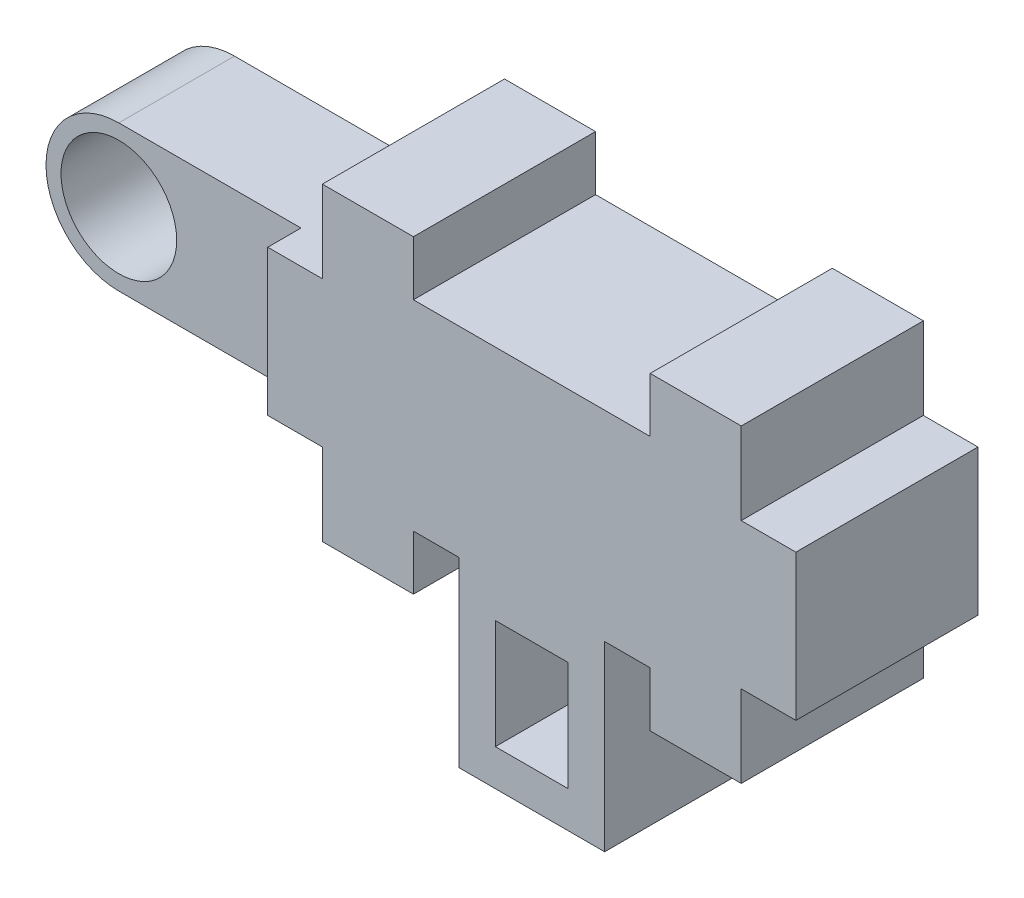
ISO-10303-21;
HEADER;
FILE_DESCRIPTION(('STEP AP214'),'2;1');
FILE_NAME('part.step','',(''),(''),'','','');
FILE_SCHEMA(('AUTOMOTIVE_DESIGN { 1 0 10303 214 1 1 1 1 }'));
ENDSEC;
DATA;
#1=APPLICATION_CONTEXT('core data for automotive mechanical design processes');
#2=APPLICATION_PROTOCOL_DEFINITION('international standard','automotive_design',2000,#1);
#3=PRODUCT_CONTEXT('',#1,'mechanical');
#4=PRODUCT('Part','Part','',(#3));
#5=PRODUCT_RELATED_PRODUCT_CATEGORY('part','',(#4));
#6=PRODUCT_DEFINITION_FORMATION('','',#4);
#7=PRODUCT_DEFINITION_CONTEXT('part definition',#1,'design');
#8=PRODUCT_DEFINITION('design','',#6,#7);
#9=PRODUCT_DEFINITION_SHAPE('','',#8);
#10=(LENGTH_UNIT() NAMED_UNIT(*) SI_UNIT(.MILLI.,.METRE.));
#11=(NAMED_UNIT(*) PLANE_ANGLE_UNIT() SI_UNIT($,.RADIAN.));
#12=(NAMED_UNIT(*) SI_UNIT($,.STERADIAN.) SOLID_ANGLE_UNIT());
#13=UNCERTAINTY_MEASURE_WITH_UNIT(LENGTH_MEASURE(1.E-05),#10,'distance_accuracy_value','');
#14=(GEOMETRIC_REPRESENTATION_CONTEXT(3) GLOBAL_UNCERTAINTY_ASSIGNED_CONTEXT((#13)) GLOBAL_UNIT_ASSIGNED_CONTEXT((#10,
#11,#12)) REPRESENTATION_CONTEXT('',''));
#15=CARTESIAN_POINT('',(0.,0.,0.));
#16=DIRECTION('',(0.,0.,1.));
#17=DIRECTION('',(1.,0.,0.));
#18=AXIS2_PLACEMENT_3D('',#15,#16,#17);
#19=CARTESIAN_POINT('',(-11.6509196702885,1.46686978452833,-4.0875));
#20=DIRECTION('',(0.,0.,1.));
#21=DIRECTION('',(1.,0.,0.));
#22=AXIS2_PLACEMENT_3D('',#19,#20,#21);
#23=PLANE('',#22);
#24=CARTESIAN_POINT('',(-9.65091967028846,3.46686978452833,-4.0875));
#25=DIRECTION('',(0.,0.,1.));
#26=DIRECTION('',(1.,0.,0.));
#27=AXIS2_PLACEMENT_3D('',#24,#25,#26);
#28=CIRCLE('',#27,1.5875);
#29=CARTESIAN_POINT('',(-8.06341967028846,3.46686978452833,-4.0875));
#30=VERTEX_POINT('',#29);
#31=EDGE_CURVE('E298',#30,#30,#28,.F.);
#32=ORIENTED_EDGE('',*,*,#31,.F.);
#33=EDGE_LOOP('',(#32));
#34=FACE_BOUND('',#33,.T.);
#35=CARTESIAN_POINT('',(-9.65091967028846,3.46686978452833,-4.0875));
#36=DIRECTION('',(0.,0.,1.));
#37=DIRECTION('',(1.,0.,0.));
#38=AXIS2_PLACEMENT_3D('',#35,#36,#37);
#39=CIRCLE('',#38,2.);
#40=CARTESIAN_POINT('',(-9.65091967028846,1.46686978452833,-4.0875));
#41=VERTEX_POINT('',#40);
#42=CARTESIAN_POINT('',(-9.65091967028846,5.46686978452833,-4.0875));
#43=VERTEX_POINT('',#42);
#44=EDGE_CURVE('E309',#41,#43,#39,.F.);
#45=ORIENTED_EDGE('',*,*,#44,.T.);
#46=DIRECTION('',(1.,0.,0.));
#47=VECTOR('',#46,1.);
#48=CARTESIAN_POINT('',(-11.6509196702885,5.46686978452833,-4.0875));
#49=LINE('',#48,#47);
#50=CARTESIAN_POINT('',(-4.65091967028846,5.46686978452833,-4.0875));
#51=VERTEX_POINT('',#50);
#52=EDGE_CURVE('E331',#43,#51,#49,.T.);
#53=ORIENTED_EDGE('',*,*,#52,.T.);
#54=DIRECTION('',(0.,-1.,0.));
#55=VECTOR('',#54,1.);
#56=CARTESIAN_POINT('',(-4.65091967028846,1.46686978452833,-4.0875));
#57=LINE('',#56,#55);
#58=CARTESIAN_POINT('',(-4.65091967028846,1.46686978452833,-4.0875));
#59=VERTEX_POINT('',#58);
#60=EDGE_CURVE('E311',#51,#59,#57,.T.);
#61=ORIENTED_EDGE('',*,*,#60,.T.);
#62=DIRECTION('',(1.,0.,0.));
#63=VECTOR('',#62,1.);
#64=CARTESIAN_POINT('',(-11.6509196702885,1.46686978452833,-4.0875));
#65=LINE('',#64,#63);
#66=EDGE_CURVE('E332',#41,#59,#65,.T.);
#67=ORIENTED_EDGE('',*,*,#66,.F.);
#68=EDGE_LOOP('',(#45,#53,#61,#67));
#69=FACE_BOUND('',#68,.T.);
#70=ADVANCED_FACE('F57',(#34,#69),#23,.F.);
#71=CARTESIAN_POINT('',(-11.6509196702885,5.46686978452833,-0.912500000000001));
#72=DIRECTION('',(0.,0.,-1.));
#73=DIRECTION('',(0.,1.,0.));
#74=AXIS2_PLACEMENT_3D('',#71,#72,#73);
#75=PLANE('',#74);
#76=CARTESIAN_POINT('',(-9.65091967028846,3.46686978452833,-0.912499999999998));
#77=DIRECTION('',(0.,0.,1.));
#78=DIRECTION('',(1.,0.,0.));
#79=AXIS2_PLACEMENT_3D('',#76,#77,#78);
#80=CIRCLE('',#79,1.5875);
#81=CARTESIAN_POINT('',(-8.06341967028846,3.46686978452833,-0.912499999999998));
#82=VERTEX_POINT('',#81);
#83=EDGE_CURVE('E302',#82,#82,#80,.T.);
#84=ORIENTED_EDGE('',*,*,#83,.F.);
#85=EDGE_LOOP('',(#84));
#86=FACE_BOUND('',#85,.T.);
#87=DIRECTION('',(1.,0.,0.));
#88=VECTOR('',#87,1.);
#89=CARTESIAN_POINT('',(-11.6509196702885,5.46686978452833,-0.912500000000001));
#90=LINE('',#89,#88);
#91=CARTESIAN_POINT('',(-9.65091967028846,5.46686978452833,-0.912499999999998));
#92=VERTEX_POINT('',#91);
#93=CARTESIAN_POINT('',(-4.65091967028846,5.46686978452833,-0.912500000000001));
#94=VERTEX_POINT('',#93);
#95=EDGE_CURVE('E61',#92,#94,#90,.T.);
#96=ORIENTED_EDGE('',*,*,#95,.F.);
#97=CARTESIAN_POINT('',(-9.65091967028846,3.46686978452833,-0.912499999999998));
#98=DIRECTION('',(0.,0.,1.));
#99=DIRECTION('',(1.,0.,0.));
#100=AXIS2_PLACEMENT_3D('',#97,#98,#99);
#101=CIRCLE('',#100,2.);
#102=CARTESIAN_POINT('',(-9.65091967028846,1.46686978452833,-0.912499999999998));
#103=VERTEX_POINT('',#102);
#104=EDGE_CURVE('E308',#92,#103,#101,.T.);
#105=ORIENTED_EDGE('',*,*,#104,.T.);
#106=DIRECTION('',(1.,0.,0.));
#107=VECTOR('',#106,1.);
#108=CARTESIAN_POINT('',(-11.6509196702885,1.46686978452833,-0.912499999999999));
#109=LINE('',#108,#107);
#110=CARTESIAN_POINT('',(-4.65091967028846,1.46686978452833,-0.9125));
#111=VERTEX_POINT('',#110);
#112=EDGE_CURVE('E329',#103,#111,#109,.T.);
#113=ORIENTED_EDGE('',*,*,#112,.T.);
#114=DIRECTION('',(0.,1.,0.));
#115=VECTOR('',#114,1.);
#116=CARTESIAN_POINT('',(-4.65091967028846,5.46686978452833,-0.912500000000001));
#117=LINE('',#116,#115);
#118=EDGE_CURVE('E324',#111,#94,#117,.T.);
#119=ORIENTED_EDGE('',*,*,#118,.T.);
#120=EDGE_LOOP('',(#96,#105,#113,#119));
#121=FACE_BOUND('',#120,.T.);
#122=ADVANCED_FACE('F363',(#86,#121),#75,.F.);
#123=CARTESIAN_POINT('',(-3.15091967028846,5.46686978452833,-5.));
#124=DIRECTION('',(0.,1.,0.));
#125=DIRECTION('',(0.,0.,1.));
#126=AXIS2_PLACEMENT_3D('',#123,#124,#125);
#127=PLANE('',#126);
#128=ORIENTED_EDGE('',*,*,#52,.F.);
#129=DIRECTION('',(0.,0.,1.));
#130=VECTOR('',#129,1.);
#131=CARTESIAN_POINT('',(-9.65091967028846,5.46686978452833,-8.57762806053458));
#132=LINE('',#131,#130);
#133=EDGE_CURVE('E305',#43,#92,#132,.T.);
#134=ORIENTED_EDGE('',*,*,#133,.T.);
#135=ORIENTED_EDGE('',*,*,#95,.T.);
#136=DIRECTION('',(0.,0.,1.));
#137=VECTOR('',#136,1.);
#138=CARTESIAN_POINT('',(-4.65091967028846,5.46686978452833,-5.));
#139=LINE('',#138,#137);
#140=CARTESIAN_POINT('',(-4.65091967028846,5.46686978452833,0.));
#141=VERTEX_POINT('',#140);
#142=EDGE_CURVE('E351',#94,#141,#139,.T.);
#143=ORIENTED_EDGE('',*,*,#142,.T.);
#144=DIRECTION('',(-1.,0.,0.));
#145=VECTOR('',#144,1.);
#146=CARTESIAN_POINT('',(-3.15091967028846,5.46686978452833,0.));
#147=LINE('',#146,#145);
#148=CARTESIAN_POINT('',(-3.15091967028846,5.46686978452833,0.));
#149=VERTEX_POINT('',#148);
#150=EDGE_CURVE('E402',#149,#141,#147,.T.);
#151=ORIENTED_EDGE('',*,*,#150,.F.);
#152=DIRECTION('',(0.,0.,1.));
#153=VECTOR('',#152,1.);
#154=CARTESIAN_POINT('',(-3.15091967028846,5.46686978452833,-5.));
#155=LINE('',#154,#153);
#156=CARTESIAN_POINT('',(-3.15091967028846,5.46686978452833,-5.));
#157=VERTEX_POINT('',#156);
#158=EDGE_CURVE('E361',#157,#149,#155,.T.);
#159=ORIENTED_EDGE('',*,*,#158,.F.);
#160=DIRECTION('',(-1.,0.,0.));
#161=VECTOR('',#160,1.);
#162=CARTESIAN_POINT('',(-3.15091967028846,5.46686978452833,-5.));
#163=LINE('',#162,#161);
#164=CARTESIAN_POINT('',(-4.65091967028846,5.46686978452833,-5.));
#165=VERTEX_POINT('',#164);
#166=EDGE_CURVE('E512',#157,#165,#163,.T.);
#167=ORIENTED_EDGE('',*,*,#166,.T.);
#168=EDGE_CURVE('E360',#165,#51,#139,.T.);
#169=ORIENTED_EDGE('',*,*,#168,.T.);
#170=EDGE_LOOP('',(#128,#134,#135,#143,#151,#159,#167,#169));
#171=FACE_BOUND('',#170,.T.);
#172=ADVANCED_FACE('F349',(#171),#127,.T.);
#173=CARTESIAN_POINT('',(-4.65091967028846,5.46686978452833,-5.));
#174=DIRECTION('',(-1.,0.,0.));
#175=DIRECTION('',(0.,0.,1.));
#176=AXIS2_PLACEMENT_3D('',#173,#174,#175);
#177=PLANE('',#176);
#178=ORIENTED_EDGE('',*,*,#60,.F.);
#179=ORIENTED_EDGE('',*,*,#168,.F.);
#180=DIRECTION('',(0.,-1.,0.));
#181=VECTOR('',#180,1.);
#182=CARTESIAN_POINT('',(-4.65091967028846,5.46686978452833,-5.));
#183=LINE('',#182,#181);
#184=CARTESIAN_POINT('',(-4.65091967028846,1.46686978452833,-5.));
#185=VERTEX_POINT('',#184);
#186=EDGE_CURVE('E509',#165,#185,#183,.T.);
#187=ORIENTED_EDGE('',*,*,#186,.T.);
#188=DIRECTION('',(0.,0.,1.));
#189=VECTOR('',#188,1.);
#190=CARTESIAN_POINT('',(-4.65091967028846,1.46686978452833,-5.));
#191=LINE('',#190,#189);
#192=EDGE_CURVE('E371',#185,#59,#191,.T.);
#193=ORIENTED_EDGE('',*,*,#192,.T.);
#194=EDGE_LOOP('',(#178,#179,#187,#193));
#195=FACE_BOUND('',#194,.T.);
#196=ADVANCED_FACE('F507',(#195),#177,.T.);
#197=CARTESIAN_POINT('',(-0.650919670288454,6.21686978452833,-5.));
#198=DIRECTION('',(1.,0.,0.));
#199=DIRECTION('',(0.,0.,-1.));
#200=AXIS2_PLACEMENT_3D('',#197,#198,#199);
#201=PLANE('',#200);
#202=DIRECTION('',(0.,1.,0.));
#203=VECTOR('',#202,1.);
#204=CARTESIAN_POINT('',(-0.650919670288454,6.21686978452833,0.));
#205=LINE('',#204,#203);
#206=CARTESIAN_POINT('',(-0.650919670288454,6.21686978452833,0.));
#207=VERTEX_POINT('',#206);
#208=CARTESIAN_POINT('',(-0.650919670288454,7.71686978452833,0.));
#209=VERTEX_POINT('',#208);
#210=EDGE_CURVE('E333',#207,#209,#205,.T.);
#211=ORIENTED_EDGE('',*,*,#210,.F.);
#212=DIRECTION('',(0.,0.,1.));
#213=VECTOR('',#212,1.);
#214=CARTESIAN_POINT('',(-0.650919670288454,6.21686978452833,-5.));
#215=LINE('',#214,#213);
#216=CARTESIAN_POINT('',(-0.650919670288454,6.21686978452833,-5.));
#217=VERTEX_POINT('',#216);
#218=EDGE_CURVE('E12',#217,#207,#215,.T.);
#219=ORIENTED_EDGE('',*,*,#218,.F.);
#220=DIRECTION('',(0.,1.,0.));
#221=VECTOR('',#220,1.);
#222=CARTESIAN_POINT('',(-0.650919670288454,6.21686978452833,-5.));
#223=LINE('',#222,#221);
#224=CARTESIAN_POINT('',(-0.650919670288454,7.71686978452833,-5.));
#225=VERTEX_POINT('',#224);
#226=EDGE_CURVE('E464',#217,#225,#223,.T.);
#227=ORIENTED_EDGE('',*,*,#226,.T.);
#228=DIRECTION('',(0.,0.,1.));
#229=VECTOR('',#228,1.);
#230=CARTESIAN_POINT('',(-0.650919670288454,7.71686978452833,-5.));
#231=LINE('',#230,#229);
#232=EDGE_CURVE('E385',#225,#209,#231,.T.);
#233=ORIENTED_EDGE('',*,*,#232,.T.);
#234=EDGE_LOOP('',(#211,#219,#227,#233));
#235=FACE_BOUND('',#234,.T.);
#236=ADVANCED_FACE('F59',(#235),#201,.T.);
#237=CARTESIAN_POINT('',(5.84908032971154,6.21686978452833,-5.));
#238=DIRECTION('',(0.,1.,0.));
#239=DIRECTION('',(0.,0.,1.));
#240=AXIS2_PLACEMENT_3D('',#237,#238,#239);
#241=PLANE('',#240);
#242=DIRECTION('',(-1.,0.,0.));
#243=VECTOR('',#242,1.);
#244=CARTESIAN_POINT('',(5.84908032971154,6.21686978452833,0.));
#245=LINE('',#244,#243);
#246=CARTESIAN_POINT('',(5.84908032971154,6.21686978452833,0.));
#247=VERTEX_POINT('',#246);
#248=EDGE_CURVE('E462',#247,#207,#245,.T.);
#249=ORIENTED_EDGE('',*,*,#248,.F.);
#250=DIRECTION('',(0.,0.,1.));
#251=VECTOR('',#250,1.);
#252=CARTESIAN_POINT('',(5.84908032971154,6.21686978452833,-5.));
#253=LINE('',#252,#251);
#254=CARTESIAN_POINT('',(5.84908032971154,6.21686978452833,-5.));
#255=VERTEX_POINT('',#254);
#256=EDGE_CURVE('E67',#255,#247,#253,.T.);
#257=ORIENTED_EDGE('',*,*,#256,.F.);
#258=DIRECTION('',(-1.,0.,0.));
#259=VECTOR('',#258,1.);
#260=CARTESIAN_POINT('',(5.84908032971154,6.21686978452833,-5.));
#261=LINE('',#260,#259);
#262=EDGE_CURVE('E387',#255,#217,#261,.T.);
#263=ORIENTED_EDGE('',*,*,#262,.T.);
#264=ORIENTED_EDGE('',*,*,#218,.T.);
#265=EDGE_LOOP('',(#249,#257,#263,#264));
#266=FACE_BOUND('',#265,.T.);
#267=ADVANCED_FACE('F576',(#266),#241,.T.);
#268=CARTESIAN_POINT('',(5.84908032971154,6.21686978452833,-5.));
#269=DIRECTION('',(-1.,0.,0.));
#270=DIRECTION('',(0.,0.,1.));
#271=AXIS2_PLACEMENT_3D('',#268,#269,#270);
#272=PLANE('',#271);
#273=DIRECTION('',(0.,-1.,0.));
#274=VECTOR('',#273,1.);
#275=CARTESIAN_POINT('',(5.84908032971154,6.21686978452833,0.));
#276=LINE('',#275,#274);
#277=CARTESIAN_POINT('',(5.84908032971154,7.71686978452833,0.));
#278=VERTEX_POINT('',#277);
#279=EDGE_CURVE('E459',#278,#247,#276,.T.);
#280=ORIENTED_EDGE('',*,*,#279,.F.);
#281=DIRECTION('',(0.,0.,1.));
#282=VECTOR('',#281,1.);
#283=CARTESIAN_POINT('',(5.84908032971154,7.71686978452833,-5.));
#284=LINE('',#283,#282);
#285=CARTESIAN_POINT('',(5.84908032971154,7.71686978452833,-5.));
#286=VERTEX_POINT('',#285);
#287=EDGE_CURVE('E467',#286,#278,#284,.T.);
#288=ORIENTED_EDGE('',*,*,#287,.F.);
#289=DIRECTION('',(0.,-1.,0.));
#290=VECTOR('',#289,1.);
#291=CARTESIAN_POINT('',(5.84908032971154,6.21686978452833,-5.));
#292=LINE('',#291,#290);
#293=EDGE_CURVE('E569',#286,#255,#292,.T.);
#294=ORIENTED_EDGE('',*,*,#293,.T.);
#295=ORIENTED_EDGE('',*,*,#256,.T.);
#296=EDGE_LOOP('',(#280,#288,#294,#295));
#297=FACE_BOUND('',#296,.T.);
#298=ADVANCED_FACE('F589',(#297),#272,.T.);
#299=CARTESIAN_POINT('',(5.84908032971154,7.71686978452833,-5.));
#300=DIRECTION('',(0.,1.,0.));
#301=DIRECTION('',(0.,0.,1.));
#302=AXIS2_PLACEMENT_3D('',#299,#300,#301);
#303=PLANE('',#302);
#304=DIRECTION('',(-1.,0.,0.));
#305=VECTOR('',#304,1.);
#306=CARTESIAN_POINT('',(5.84908032971154,7.71686978452833,0.));
#307=LINE('',#306,#305);
#308=CARTESIAN_POINT('',(8.34908032971154,7.71686978452833,0.));
#309=VERTEX_POINT('',#308);
#310=EDGE_CURVE('E456',#309,#278,#307,.T.);
#311=ORIENTED_EDGE('',*,*,#310,.F.);
#312=DIRECTION('',(0.,0.,1.));
#313=VECTOR('',#312,1.);
#314=CARTESIAN_POINT('',(8.34908032971154,7.71686978452833,-5.));
#315=LINE('',#314,#313);
#316=CARTESIAN_POINT('',(8.34908032971154,7.71686978452833,-5.));
#317=VERTEX_POINT('',#316);
#318=EDGE_CURVE('E469',#317,#309,#315,.T.);
#319=ORIENTED_EDGE('',*,*,#318,.F.);
#320=DIRECTION('',(-1.,0.,0.));
#321=VECTOR('',#320,1.);
#322=CARTESIAN_POINT('',(5.84908032971154,7.71686978452833,-5.));
#323=LINE('',#322,#321);
#324=EDGE_CURVE('E566',#317,#286,#323,.T.);
#325=ORIENTED_EDGE('',*,*,#324,.T.);
#326=ORIENTED_EDGE('',*,*,#287,.T.);
#327=EDGE_LOOP('',(#311,#319,#325,#326));
#328=FACE_BOUND('',#327,.T.);
#329=ADVANCED_FACE('F591',(#328),#303,.T.);
#330=CARTESIAN_POINT('',(8.34908032971154,7.71686978452833,-5.));
#331=DIRECTION('',(1.,0.,0.));
#332=DIRECTION('',(0.,0.,-1.));
#333=AXIS2_PLACEMENT_3D('',#330,#331,#332);
#334=PLANE('',#333);
#335=DIRECTION('',(0.,1.,0.));
#336=VECTOR('',#335,1.);
#337=CARTESIAN_POINT('',(8.34908032971154,7.71686978452833,0.));
#338=LINE('',#337,#336);
#339=CARTESIAN_POINT('',(8.34908032971154,5.46686978452833,0.));
#340=VERTEX_POINT('',#339);
#341=EDGE_CURVE('E453',#340,#309,#338,.T.);
#342=ORIENTED_EDGE('',*,*,#341,.F.);
#343=DIRECTION('',(0.,0.,1.));
#344=VECTOR('',#343,1.);
#345=CARTESIAN_POINT('',(8.34908032971154,5.46686978452833,-5.));
#346=LINE('',#345,#344);
#347=CARTESIAN_POINT('',(8.34908032971154,5.46686978452833,-5.));
#348=VERTEX_POINT('',#347);
#349=EDGE_CURVE('E471',#348,#340,#346,.T.);
#350=ORIENTED_EDGE('',*,*,#349,.F.);
#351=DIRECTION('',(0.,1.,0.));
#352=VECTOR('',#351,1.);
#353=CARTESIAN_POINT('',(8.34908032971154,7.71686978452833,-5.));
#354=LINE('',#353,#352);
#355=EDGE_CURVE('E563',#348,#317,#354,.T.);
#356=ORIENTED_EDGE('',*,*,#355,.T.);
#357=ORIENTED_EDGE('',*,*,#318,.T.);
#358=EDGE_LOOP('',(#342,#350,#356,#357));
#359=FACE_BOUND('',#358,.T.);
#360=ADVANCED_FACE('F596',(#359),#334,.T.);
#361=CARTESIAN_POINT('',(8.34908032971154,5.46686978452833,-5.));
#362=DIRECTION('',(0.,1.,0.));
#363=DIRECTION('',(0.,0.,1.));
#364=AXIS2_PLACEMENT_3D('',#361,#362,#363);
#365=PLANE('',#364);
#366=DIRECTION('',(-1.,0.,0.));
#367=VECTOR('',#366,1.);
#368=CARTESIAN_POINT('',(8.34908032971154,5.46686978452833,0.));
#369=LINE('',#368,#367);
#370=CARTESIAN_POINT('',(9.84908032971154,5.46686978452833,0.));
#371=VERTEX_POINT('',#370);
#372=EDGE_CURVE('E450',#371,#340,#369,.T.);
#373=ORIENTED_EDGE('',*,*,#372,.F.);
#374=DIRECTION('',(0.,0.,1.));
#375=VECTOR('',#374,1.);
#376=CARTESIAN_POINT('',(9.84908032971154,5.46686978452833,-5.));
#377=LINE('',#376,#375);
#378=CARTESIAN_POINT('',(9.84908032971154,5.46686978452833,-5.));
#379=VERTEX_POINT('',#378);
#380=EDGE_CURVE('E473',#379,#371,#377,.T.);
#381=ORIENTED_EDGE('',*,*,#380,.F.);
#382=DIRECTION('',(-1.,0.,0.));
#383=VECTOR('',#382,1.);
#384=CARTESIAN_POINT('',(8.34908032971154,5.46686978452833,-5.));
#385=LINE('',#384,#383);
#386=EDGE_CURVE('E560',#379,#348,#385,.T.);
#387=ORIENTED_EDGE('',*,*,#386,.T.);
#388=ORIENTED_EDGE('',*,*,#349,.T.);
#389=EDGE_LOOP('',(#373,#381,#387,#388));
#390=FACE_BOUND('',#389,.T.);
#391=ADVANCED_FACE('F599',(#390),#365,.T.);
#392=CARTESIAN_POINT('',(9.84908032971154,5.46686978452833,-5.));
#393=DIRECTION('',(1.,0.,0.));
#394=DIRECTION('',(0.,0.,-1.));
#395=AXIS2_PLACEMENT_3D('',#392,#393,#394);
#396=PLANE('',#395);
#397=DIRECTION('',(0.,1.,0.));
#398=VECTOR('',#397,1.);
#399=CARTESIAN_POINT('',(9.84908032971154,5.46686978452833,0.));
#400=LINE('',#399,#398);
#401=CARTESIAN_POINT('',(9.84908032971154,1.46686978452833,0.));
#402=VERTEX_POINT('',#401);
#403=EDGE_CURVE('E447',#402,#371,#400,.T.);
#404=ORIENTED_EDGE('',*,*,#403,.F.);
#405=DIRECTION('',(0.,0.,1.));
#406=VECTOR('',#405,1.);
#407=CARTESIAN_POINT('',(9.84908032971154,1.46686978452833,-5.));
#408=LINE('',#407,#406);
#409=CARTESIAN_POINT('',(9.84908032971154,1.46686978452833,-5.));
#410=VERTEX_POINT('',#409);
#411=EDGE_CURVE('E475',#410,#402,#408,.T.);
#412=ORIENTED_EDGE('',*,*,#411,.F.);
#413=DIRECTION('',(0.,1.,0.));
#414=VECTOR('',#413,1.);
#415=CARTESIAN_POINT('',(9.84908032971154,5.46686978452833,-5.));
#416=LINE('',#415,#414);
#417=EDGE_CURVE('E557',#410,#379,#416,.T.);
#418=ORIENTED_EDGE('',*,*,#417,.T.);
#419=ORIENTED_EDGE('',*,*,#380,.T.);
#420=EDGE_LOOP('',(#404,#412,#418,#419));
#421=FACE_BOUND('',#420,.T.);
#422=ADVANCED_FACE('F604',(#421),#396,.T.);
#423=CARTESIAN_POINT('',(9.84908032971154,1.46686978452833,-5.));
#424=DIRECTION('',(0.,-1.,0.));
#425=DIRECTION('',(1.,0.,0.));
#426=AXIS2_PLACEMENT_3D('',#423,#424,#425);
#427=PLANE('',#426);
#428=DIRECTION('',(1.,0.,0.));
#429=VECTOR('',#428,1.);
#430=CARTESIAN_POINT('',(9.84908032971154,1.46686978452833,0.));
#431=LINE('',#430,#429);
#432=CARTESIAN_POINT('',(8.34908032971154,1.46686978452833,0.));
#433=VERTEX_POINT('',#432);
#434=EDGE_CURVE('E444',#433,#402,#431,.T.);
#435=ORIENTED_EDGE('',*,*,#434,.F.);
#436=DIRECTION('',(0.,0.,1.));
#437=VECTOR('',#436,1.);
#438=CARTESIAN_POINT('',(8.34908032971154,1.46686978452833,-5.));
#439=LINE('',#438,#437);
#440=CARTESIAN_POINT('',(8.34908032971154,1.46686978452833,-5.));
#441=VERTEX_POINT('',#440);
#442=EDGE_CURVE('E477',#441,#433,#439,.T.);
#443=ORIENTED_EDGE('',*,*,#442,.F.);
#444=DIRECTION('',(1.,0.,0.));
#445=VECTOR('',#444,1.);
#446=CARTESIAN_POINT('',(9.84908032971154,1.46686978452833,-5.));
#447=LINE('',#446,#445);
#448=EDGE_CURVE('E554',#441,#410,#447,.T.);
#449=ORIENTED_EDGE('',*,*,#448,.T.);
#450=ORIENTED_EDGE('',*,*,#411,.T.);
#451=EDGE_LOOP('',(#435,#443,#449,#450));
#452=FACE_BOUND('',#451,.T.);
#453=ADVANCED_FACE('F607',(#452),#427,.T.);
#454=CARTESIAN_POINT('',(8.34908032971154,1.46686978452833,-5.));
#455=DIRECTION('',(1.,0.,0.));
#456=DIRECTION('',(0.,0.,-1.));
#457=AXIS2_PLACEMENT_3D('',#454,#455,#456);
#458=PLANE('',#457);
#459=DIRECTION('',(0.,1.,0.));
#460=VECTOR('',#459,1.);
#461=CARTESIAN_POINT('',(8.34908032971154,1.46686978452833,0.));
#462=LINE('',#461,#460);
#463=CARTESIAN_POINT('',(8.34908032971154,-0.78313021547167,0.));
#464=VERTEX_POINT('',#463);
#465=EDGE_CURVE('E441',#464,#433,#462,.T.);
#466=ORIENTED_EDGE('',*,*,#465,.F.);
#467=DIRECTION('',(0.,0.,1.));
#468=VECTOR('',#467,1.);
#469=CARTESIAN_POINT('',(8.34908032971154,-0.78313021547167,-5.));
#470=LINE('',#469,#468);
#471=CARTESIAN_POINT('',(8.34908032971154,-0.78313021547167,-5.));
#472=VERTEX_POINT('',#471);
#473=EDGE_CURVE('E479',#472,#464,#470,.T.);
#474=ORIENTED_EDGE('',*,*,#473,.F.);
#475=DIRECTION('',(0.,1.,0.));
#476=VECTOR('',#475,1.);
#477=CARTESIAN_POINT('',(8.34908032971154,1.46686978452833,-5.));
#478=LINE('',#477,#476);
#479=EDGE_CURVE('E551',#472,#441,#478,.T.);
#480=ORIENTED_EDGE('',*,*,#479,.T.);
#481=ORIENTED_EDGE('',*,*,#442,.T.);
#482=EDGE_LOOP('',(#466,#474,#480,#481));
#483=FACE_BOUND('',#482,.T.);
#484=ADVANCED_FACE('F612',(#483),#458,.T.);
#485=CARTESIAN_POINT('',(8.34908032971154,-0.78313021547167,-5.));
#486=DIRECTION('',(0.,-1.,0.));
#487=DIRECTION('',(0.,0.,-1.));
#488=AXIS2_PLACEMENT_3D('',#485,#486,#487);
#489=PLANE('',#488);
#490=DIRECTION('',(1.,0.,0.));
#491=VECTOR('',#490,1.);
#492=CARTESIAN_POINT('',(8.34908032971154,-0.78313021547167,0.));
#493=LINE('',#492,#491);
#494=CARTESIAN_POINT('',(5.84908032971154,-0.78313021547167,0.));
#495=VERTEX_POINT('',#494);
#496=EDGE_CURVE('E438',#495,#464,#493,.T.);
#497=ORIENTED_EDGE('',*,*,#496,.F.);
#498=DIRECTION('',(0.,0.,1.));
#499=VECTOR('',#498,1.);
#500=CARTESIAN_POINT('',(5.84908032971154,-0.78313021547167,-5.));
#501=LINE('',#500,#499);
#502=CARTESIAN_POINT('',(5.84908032971154,-0.78313021547167,-5.));
#503=VERTEX_POINT('',#502);
#504=EDGE_CURVE('E481',#503,#495,#501,.T.);
#505=ORIENTED_EDGE('',*,*,#504,.F.);
#506=DIRECTION('',(1.,0.,0.));
#507=VECTOR('',#506,1.);
#508=CARTESIAN_POINT('',(8.34908032971154,-0.78313021547167,-5.));
#509=LINE('',#508,#507);
#510=EDGE_CURVE('E548',#503,#472,#509,.T.);
#511=ORIENTED_EDGE('',*,*,#510,.T.);
#512=ORIENTED_EDGE('',*,*,#473,.T.);
#513=EDGE_LOOP('',(#497,#505,#511,#512));
#514=FACE_BOUND('',#513,.T.);
#515=ADVANCED_FACE('F615',(#514),#489,.T.);
#516=CARTESIAN_POINT('',(5.84908032971154,-0.78313021547167,-5.));
#517=DIRECTION('',(-1.,0.,0.));
#518=DIRECTION('',(0.,0.,1.));
#519=AXIS2_PLACEMENT_3D('',#516,#517,#518);
#520=PLANE('',#519);
#521=DIRECTION('',(0.,-1.,0.));
#522=VECTOR('',#521,1.);
#523=CARTESIAN_POINT('',(5.84908032971154,-0.78313021547167,0.));
#524=LINE('',#523,#522);
#525=CARTESIAN_POINT('',(5.84908032971154,0.716869784528328,0.));
#526=VERTEX_POINT('',#525);
#527=EDGE_CURVE('E435',#526,#495,#524,.T.);
#528=ORIENTED_EDGE('',*,*,#527,.F.);
#529=DIRECTION('',(0.,0.,1.));
#530=VECTOR('',#529,1.);
#531=CARTESIAN_POINT('',(5.84908032971154,0.716869784528328,-5.));
#532=LINE('',#531,#530);
#533=CARTESIAN_POINT('',(5.84908032971154,0.716869784528328,-5.));
#534=VERTEX_POINT('',#533);
#535=EDGE_CURVE('E483',#534,#526,#532,.T.);
#536=ORIENTED_EDGE('',*,*,#535,.F.);
#537=DIRECTION('',(0.,-1.,0.));
#538=VECTOR('',#537,1.);
#539=CARTESIAN_POINT('',(5.84908032971154,-0.78313021547167,-5.));
#540=LINE('',#539,#538);
#541=EDGE_CURVE('E545',#534,#503,#540,.T.);
#542=ORIENTED_EDGE('',*,*,#541,.T.);
#543=ORIENTED_EDGE('',*,*,#504,.T.);
#544=EDGE_LOOP('',(#528,#536,#542,#543));
#545=FACE_BOUND('',#544,.T.);
#546=ADVANCED_FACE('F620',(#545),#520,.T.);
#547=CARTESIAN_POINT('',(5.84908032971154,0.716869784528328,-5.));
#548=DIRECTION('',(0.,-1.,0.));
#549=DIRECTION('',(0.,0.,-1.));
#550=AXIS2_PLACEMENT_3D('',#547,#548,#549);
#551=PLANE('',#550);
#552=DIRECTION('',(1.,0.,0.));
#553=VECTOR('',#552,1.);
#554=CARTESIAN_POINT('',(5.84908032971154,0.716869784528328,0.));
#555=LINE('',#554,#553);
#556=CARTESIAN_POINT('',(4.59908032971154,0.716869784528328,0.));
#557=VERTEX_POINT('',#556);
#558=EDGE_CURVE('E432',#557,#526,#555,.T.);
#559=ORIENTED_EDGE('',*,*,#558,.F.);
#560=DIRECTION('',(0.,0.,1.));
#561=VECTOR('',#560,1.);
#562=CARTESIAN_POINT('',(4.59908032971154,0.716869784528328,-5.));
#563=LINE('',#562,#561);
#564=CARTESIAN_POINT('',(4.59908032971154,0.716869784528328,-5.));
#565=VERTEX_POINT('',#564);
#566=EDGE_CURVE('E485',#565,#557,#563,.T.);
#567=ORIENTED_EDGE('',*,*,#566,.F.);
#568=DIRECTION('',(1.,0.,0.));
#569=VECTOR('',#568,1.);
#570=CARTESIAN_POINT('',(5.84908032971154,0.716869784528328,-5.));
#571=LINE('',#570,#569);
#572=EDGE_CURVE('E542',#565,#534,#571,.T.);
#573=ORIENTED_EDGE('',*,*,#572,.T.);
#574=ORIENTED_EDGE('',*,*,#535,.T.);
#575=EDGE_LOOP('',(#559,#567,#573,#574));
#576=FACE_BOUND('',#575,.T.);
#577=ADVANCED_FACE('F623',(#576),#551,.T.);
#578=CARTESIAN_POINT('',(4.59908032971154,0.716869784528328,-5.));
#579=DIRECTION('',(1.,0.,0.));
#580=DIRECTION('',(0.,0.,-1.));
#581=AXIS2_PLACEMENT_3D('',#578,#579,#580);
#582=PLANE('',#581);
#583=DIRECTION('',(0.,1.,0.));
#584=VECTOR('',#583,1.);
#585=CARTESIAN_POINT('',(4.59908032971154,0.716869784528328,0.));
#586=LINE('',#585,#584);
#587=CARTESIAN_POINT('',(4.59908032971154,-4.28313021547167,0.));
#588=VERTEX_POINT('',#587);
#589=EDGE_CURVE('E429',#588,#557,#586,.T.);
#590=ORIENTED_EDGE('',*,*,#589,.F.);
#591=DIRECTION('',(0.,0.,1.));
#592=VECTOR('',#591,1.);
#593=CARTESIAN_POINT('',(4.59908032971154,-4.28313021547167,-5.));
#594=LINE('',#593,#592);
#595=CARTESIAN_POINT('',(4.59908032971154,-4.28313021547167,-5.));
#596=VERTEX_POINT('',#595);
#597=EDGE_CURVE('E487',#596,#588,#594,.T.);
#598=ORIENTED_EDGE('',*,*,#597,.F.);
#599=DIRECTION('',(0.,1.,0.));
#600=VECTOR('',#599,1.);
#601=CARTESIAN_POINT('',(4.59908032971154,-4.28313021547167,-5.));
#602=LINE('',#601,#600);
#603=EDGE_CURVE('E540',#596,#565,#602,.T.);
#604=ORIENTED_EDGE('',*,*,#603,.T.);
#605=ORIENTED_EDGE('',*,*,#566,.T.);
#606=EDGE_LOOP('',(#590,#598,#604,#605));
#607=FACE_BOUND('',#606,.T.);
#608=ADVANCED_FACE('F695',(#607),#582,.T.);
#609=CARTESIAN_POINT('',(0.599080329711542,-4.28313021547167,-5.));
#610=DIRECTION('',(0.,-1.,0.));
#611=DIRECTION('',(0.,0.,-1.));
#612=AXIS2_PLACEMENT_3D('',#609,#610,#611);
#613=PLANE('',#612);
#614=CARTESIAN_POINT('',(2.59908032971154,-4.28313021547167,-2.5));
#615=DIRECTION('',(0.,-1.,0.));
#616=DIRECTION('',(0.,0.,-1.));
#617=AXIS2_PLACEMENT_3D('',#614,#615,#616);
#618=CIRCLE('',#617,0.75);
#619=CARTESIAN_POINT('',(2.59908032971154,-4.28313021547167,-3.25));
#620=VERTEX_POINT('',#619);
#621=EDGE_CURVE('E864',#620,#620,#618,.T.);
#622=ORIENTED_EDGE('',*,*,#621,.F.);
#623=EDGE_LOOP('',(#622));
#624=FACE_BOUND('',#623,.T.);
#625=DIRECTION('',(1.,0.,0.));
#626=VECTOR('',#625,1.);
#627=CARTESIAN_POINT('',(0.599080329711542,-4.28313021547167,0.));
#628=LINE('',#627,#626);
#629=CARTESIAN_POINT('',(0.599080329711542,-4.28313021547167,0.));
#630=VERTEX_POINT('',#629);
#631=EDGE_CURVE('E426',#630,#588,#628,.T.);
#632=ORIENTED_EDGE('',*,*,#631,.F.);
#633=DIRECTION('',(0.,0.,1.));
#634=VECTOR('',#633,1.);
#635=CARTESIAN_POINT('',(0.599080329711542,-4.28313021547167,-5.));
#636=LINE('',#635,#634);
#637=CARTESIAN_POINT('',(0.599080329711542,-4.28313021547167,-5.));
#638=VERTEX_POINT('',#637);
#639=EDGE_CURVE('E490',#638,#630,#636,.T.);
#640=ORIENTED_EDGE('',*,*,#639,.F.);
#641=DIRECTION('',(1.,0.,0.));
#642=VECTOR('',#641,1.);
#643=CARTESIAN_POINT('',(0.599080329711542,-4.28313021547167,-5.));
#644=LINE('',#643,#642);
#645=EDGE_CURVE('E537',#638,#596,#644,.T.);
#646=ORIENTED_EDGE('',*,*,#645,.T.);
#647=ORIENTED_EDGE('',*,*,#597,.T.);
#648=EDGE_LOOP('',(#632,#640,#646,#647));
#649=FACE_BOUND('',#648,.T.);
#650=ADVANCED_FACE('F631',(#624,#649),#613,.T.);
#651=CARTESIAN_POINT('',(0.599080329711542,0.716869784528328,-5.));
#652=DIRECTION('',(-1.,0.,0.));
#653=DIRECTION('',(0.,-1.,0.));
#654=AXIS2_PLACEMENT_3D('',#651,#652,#653);
#655=PLANE('',#654);
#656=DIRECTION('',(0.,-1.,0.));
#657=VECTOR('',#656,1.);
#658=CARTESIAN_POINT('',(0.599080329711542,0.716869784528328,0.));
#659=LINE('',#658,#657);
#660=CARTESIAN_POINT('',(0.599080329711542,0.716869784528328,0.));
#661=VERTEX_POINT('',#660);
#662=EDGE_CURVE('E423',#661,#630,#659,.T.);
#663=ORIENTED_EDGE('',*,*,#662,.F.);
#664=DIRECTION('',(0.,0.,1.));
#665=VECTOR('',#664,1.);
#666=CARTESIAN_POINT('',(0.599080329711542,0.716869784528328,-5.));
#667=LINE('',#666,#665);
#668=CARTESIAN_POINT('',(0.599080329711542,0.716869784528328,-5.));
#669=VERTEX_POINT('',#668);
#670=EDGE_CURVE('E492',#669,#661,#667,.T.);
#671=ORIENTED_EDGE('',*,*,#670,.F.);
#672=DIRECTION('',(0.,-1.,0.));
#673=VECTOR('',#672,1.);
#674=CARTESIAN_POINT('',(0.599080329711542,0.716869784528328,-5.));
#675=LINE('',#674,#673);
#676=EDGE_CURVE('E534',#669,#638,#675,.T.);
#677=ORIENTED_EDGE('',*,*,#676,.T.);
#678=ORIENTED_EDGE('',*,*,#639,.T.);
#679=EDGE_LOOP('',(#663,#671,#677,#678));
#680=FACE_BOUND('',#679,.T.);
#681=ADVANCED_FACE('F634',(#680),#655,.T.);
#682=CARTESIAN_POINT('',(0.599080329711542,0.716869784528328,-5.));
#683=DIRECTION('',(0.,-1.,0.));
#684=DIRECTION('',(1.,0.,0.));
#685=AXIS2_PLACEMENT_3D('',#682,#683,#684);
#686=PLANE('',#685);
#687=DIRECTION('',(1.,0.,0.));
#688=VECTOR('',#687,1.);
#689=CARTESIAN_POINT('',(0.599080329711542,0.716869784528328,0.));
#690=LINE('',#689,#688);
#691=CARTESIAN_POINT('',(-0.650919670288458,0.716869784528327,0.));
#692=VERTEX_POINT('',#691);
#693=EDGE_CURVE('E420',#692,#661,#690,.T.);
#694=ORIENTED_EDGE('',*,*,#693,.F.);
#695=DIRECTION('',(0.,0.,1.));
#696=VECTOR('',#695,1.);
#697=CARTESIAN_POINT('',(-0.650919670288458,0.716869784528327,-5.));
#698=LINE('',#697,#696);
#699=CARTESIAN_POINT('',(-0.650919670288458,0.716869784528327,-5.));
#700=VERTEX_POINT('',#699);
#701=EDGE_CURVE('E494',#700,#692,#698,.T.);
#702=ORIENTED_EDGE('',*,*,#701,.F.);
#703=DIRECTION('',(1.,0.,0.));
#704=VECTOR('',#703,1.);
#705=CARTESIAN_POINT('',(0.599080329711542,0.716869784528328,-5.));
#706=LINE('',#705,#704);
#707=EDGE_CURVE('E531',#700,#669,#706,.T.);
#708=ORIENTED_EDGE('',*,*,#707,.T.);
#709=ORIENTED_EDGE('',*,*,#670,.T.);
#710=EDGE_LOOP('',(#694,#702,#708,#709));
#711=FACE_BOUND('',#710,.T.);
#712=ADVANCED_FACE('F639',(#711),#686,.T.);
#713=CARTESIAN_POINT('',(-0.650919670288458,-0.783130215471672,-5.));
#714=DIRECTION('',(1.,0.,0.));
#715=DIRECTION('',(0.,0.,-1.));
#716=AXIS2_PLACEMENT_3D('',#713,#714,#715);
#717=PLANE('',#716);
#718=DIRECTION('',(0.,1.,0.));
#719=VECTOR('',#718,1.);
#720=CARTESIAN_POINT('',(-0.650919670288458,-0.783130215471672,0.));
#721=LINE('',#720,#719);
#722=CARTESIAN_POINT('',(-0.650919670288458,-0.783130215471672,0.));
#723=VERTEX_POINT('',#722);
#724=EDGE_CURVE('E417',#723,#692,#721,.T.);
#725=ORIENTED_EDGE('',*,*,#724,.F.);
#726=DIRECTION('',(0.,0.,1.));
#727=VECTOR('',#726,1.);
#728=CARTESIAN_POINT('',(-0.650919670288458,-0.783130215471672,-5.));
#729=LINE('',#728,#727);
#730=CARTESIAN_POINT('',(-0.650919670288458,-0.783130215471672,-5.));
#731=VERTEX_POINT('',#730);
#732=EDGE_CURVE('E496',#731,#723,#729,.T.);
#733=ORIENTED_EDGE('',*,*,#732,.F.);
#734=DIRECTION('',(0.,1.,0.));
#735=VECTOR('',#734,1.);
#736=CARTESIAN_POINT('',(-0.650919670288458,-0.783130215471672,-5.));
#737=LINE('',#736,#735);
#738=EDGE_CURVE('E528',#731,#700,#737,.T.);
#739=ORIENTED_EDGE('',*,*,#738,.T.);
#740=ORIENTED_EDGE('',*,*,#701,.T.);
#741=EDGE_LOOP('',(#725,#733,#739,#740));
#742=FACE_BOUND('',#741,.T.);
#743=ADVANCED_FACE('F642',(#742),#717,.T.);
#744=CARTESIAN_POINT('',(-3.15091967028846,-0.783130215471672,-5.));
#745=DIRECTION('',(0.,-1.,0.));
#746=DIRECTION('',(0.,0.,-1.));
#747=AXIS2_PLACEMENT_3D('',#744,#745,#746);
#748=PLANE('',#747);
#749=DIRECTION('',(1.,0.,0.));
#750=VECTOR('',#749,1.);
#751=CARTESIAN_POINT('',(-3.15091967028846,-0.783130215471672,0.));
#752=LINE('',#751,#750);
#753=CARTESIAN_POINT('',(-3.15091967028846,-0.783130215471672,0.));
#754=VERTEX_POINT('',#753);
#755=EDGE_CURVE('E414',#754,#723,#752,.T.);
#756=ORIENTED_EDGE('',*,*,#755,.F.);
#757=DIRECTION('',(0.,0.,1.));
#758=VECTOR('',#757,1.);
#759=CARTESIAN_POINT('',(-3.15091967028846,-0.783130215471672,-5.));
#760=LINE('',#759,#758);
#761=CARTESIAN_POINT('',(-3.15091967028846,-0.783130215471672,-5.));
#762=VERTEX_POINT('',#761);
#763=EDGE_CURVE('E497',#762,#754,#760,.T.);
#764=ORIENTED_EDGE('',*,*,#763,.F.);
#765=DIRECTION('',(1.,0.,0.));
#766=VECTOR('',#765,1.);
#767=CARTESIAN_POINT('',(-3.15091967028846,-0.783130215471672,-5.));
#768=LINE('',#767,#766);
#769=EDGE_CURVE('E525',#762,#731,#768,.T.);
#770=ORIENTED_EDGE('',*,*,#769,.T.);
#771=ORIENTED_EDGE('',*,*,#732,.T.);
#772=EDGE_LOOP('',(#756,#764,#770,#771));
#773=FACE_BOUND('',#772,.T.);
#774=ADVANCED_FACE('F645',(#773),#748,.T.);
#775=CARTESIAN_POINT('',(-3.15091967028846,1.46686978452833,-5.));
#776=DIRECTION('',(-1.,0.,0.));
#777=DIRECTION('',(0.,0.,1.));
#778=AXIS2_PLACEMENT_3D('',#775,#776,#777);
#779=PLANE('',#778);
#780=DIRECTION('',(0.,-1.,0.));
#781=VECTOR('',#780,1.);
#782=CARTESIAN_POINT('',(-3.15091967028846,1.46686978452833,0.));
#783=LINE('',#782,#781);
#784=CARTESIAN_POINT('',(-3.15091967028846,1.46686978452833,0.));
#785=VERTEX_POINT('',#784);
#786=EDGE_CURVE('E411',#785,#754,#783,.T.);
#787=ORIENTED_EDGE('',*,*,#786,.F.);
#788=DIRECTION('',(0.,0.,1.));
#789=VECTOR('',#788,1.);
#790=CARTESIAN_POINT('',(-3.15091967028846,1.46686978452833,-5.));
#791=LINE('',#790,#789);
#792=CARTESIAN_POINT('',(-3.15091967028846,1.46686978452833,-5.));
#793=VERTEX_POINT('',#792);
#794=EDGE_CURVE('E375',#793,#785,#791,.T.);
#795=ORIENTED_EDGE('',*,*,#794,.F.);
#796=DIRECTION('',(0.,-1.,0.));
#797=VECTOR('',#796,1.);
#798=CARTESIAN_POINT('',(-3.15091967028846,1.46686978452833,-5.));
#799=LINE('',#798,#797);
#800=EDGE_CURVE('E519',#793,#762,#799,.T.);
#801=ORIENTED_EDGE('',*,*,#800,.T.);
#802=ORIENTED_EDGE('',*,*,#763,.T.);
#803=EDGE_LOOP('',(#787,#795,#801,#802));
#804=FACE_BOUND('',#803,.T.);
#805=ADVANCED_FACE('F646',(#804),#779,.T.);
#806=CARTESIAN_POINT('',(-4.65091967028846,1.46686978452833,-5.));
#807=DIRECTION('',(0.,-1.,0.));
#808=DIRECTION('',(0.,0.,-1.));
#809=AXIS2_PLACEMENT_3D('',#806,#807,#808);
#810=PLANE('',#809);
#811=DIRECTION('',(0.,0.,1.));
#812=VECTOR('',#811,1.);
#813=CARTESIAN_POINT('',(-9.65091967028846,1.46686978452833,-8.57762806053458));
#814=LINE('',#813,#812);
#815=EDGE_CURVE('E312',#41,#103,#814,.T.);
#816=ORIENTED_EDGE('',*,*,#815,.F.);
#817=ORIENTED_EDGE('',*,*,#66,.T.);
#818=ORIENTED_EDGE('',*,*,#192,.F.);
#819=DIRECTION('',(1.,0.,0.));
#820=VECTOR('',#819,1.);
#821=CARTESIAN_POINT('',(-4.65091967028846,1.46686978452833,-5.));
#822=LINE('',#821,#820);
#823=EDGE_CURVE('E517',#185,#793,#822,.T.);
#824=ORIENTED_EDGE('',*,*,#823,.T.);
#825=ORIENTED_EDGE('',*,*,#794,.T.);
#826=DIRECTION('',(1.,0.,0.));
#827=VECTOR('',#826,1.);
#828=CARTESIAN_POINT('',(-4.65091967028846,1.46686978452833,0.));
#829=LINE('',#828,#827);
#830=CARTESIAN_POINT('',(-4.65091967028846,1.46686978452833,0.));
#831=VERTEX_POINT('',#830);
#832=EDGE_CURVE('E408',#831,#785,#829,.T.);
#833=ORIENTED_EDGE('',*,*,#832,.F.);
#834=EDGE_CURVE('E366',#111,#831,#191,.T.);
#835=ORIENTED_EDGE('',*,*,#834,.F.);
#836=ORIENTED_EDGE('',*,*,#112,.F.);
#837=EDGE_LOOP('',(#816,#817,#818,#824,#825,#833,#835,#836));
#838=FACE_BOUND('',#837,.T.);
#839=ADVANCED_FACE('F647',(#838),#810,.T.);
#840=ORIENTED_EDGE('',*,*,#118,.F.);
#841=ORIENTED_EDGE('',*,*,#834,.T.);
#842=DIRECTION('',(0.,-1.,0.));
#843=VECTOR('',#842,1.);
#844=CARTESIAN_POINT('',(-4.65091967028846,5.46686978452833,0.));
#845=LINE('',#844,#843);
#846=EDGE_CURVE('E358',#141,#831,#845,.T.);
#847=ORIENTED_EDGE('',*,*,#846,.F.);
#848=ORIENTED_EDGE('',*,*,#142,.F.);
#849=EDGE_LOOP('',(#840,#841,#847,#848));
#850=FACE_BOUND('',#849,.T.);
#851=ADVANCED_FACE('F355',(#850),#177,.T.);
#852=CARTESIAN_POINT('',(-3.15091967028846,7.71686978452833,-5.));
#853=DIRECTION('',(-1.,0.,0.));
#854=DIRECTION('',(0.,0.,1.));
#855=AXIS2_PLACEMENT_3D('',#852,#853,#854);
#856=PLANE('',#855);
#857=DIRECTION('',(0.,-1.,0.));
#858=VECTOR('',#857,1.);
#859=CARTESIAN_POINT('',(-3.15091967028846,7.71686978452833,0.));
#860=LINE('',#859,#858);
#861=CARTESIAN_POINT('',(-3.15091967028846,7.71686978452833,0.));
#862=VERTEX_POINT('',#861);
#863=EDGE_CURVE('E396',#862,#149,#860,.T.);
#864=ORIENTED_EDGE('',*,*,#863,.F.);
#865=DIRECTION('',(0.,0.,1.));
#866=VECTOR('',#865,1.);
#867=CARTESIAN_POINT('',(-3.15091967028846,7.71686978452833,-5.));
#868=LINE('',#867,#866);
#869=CARTESIAN_POINT('',(-3.15091967028846,7.71686978452833,-5.));
#870=VERTEX_POINT('',#869);
#871=EDGE_CURVE('E386',#870,#862,#868,.T.);
#872=ORIENTED_EDGE('',*,*,#871,.F.);
#873=DIRECTION('',(0.,-1.,0.));
#874=VECTOR('',#873,1.);
#875=CARTESIAN_POINT('',(-3.15091967028846,7.71686978452833,-5.));
#876=LINE('',#875,#874);
#877=EDGE_CURVE('E399',#870,#157,#876,.T.);
#878=ORIENTED_EDGE('',*,*,#877,.T.);
#879=ORIENTED_EDGE('',*,*,#158,.T.);
#880=EDGE_LOOP('',(#864,#872,#878,#879));
#881=FACE_BOUND('',#880,.T.);
#882=ADVANCED_FACE('F394',(#881),#856,.T.);
#883=CARTESIAN_POINT('',(-0.650919670288454,7.71686978452833,-5.));
#884=DIRECTION('',(0.,1.,0.));
#885=DIRECTION('',(0.,0.,1.));
#886=AXIS2_PLACEMENT_3D('',#883,#884,#885);
#887=PLANE('',#886);
#888=DIRECTION('',(-1.,0.,0.));
#889=VECTOR('',#888,1.);
#890=CARTESIAN_POINT('',(-0.650919670288454,7.71686978452833,0.));
#891=LINE('',#890,#889);
#892=EDGE_CURVE('E339',#209,#862,#891,.T.);
#893=ORIENTED_EDGE('',*,*,#892,.F.);
#894=ORIENTED_EDGE('',*,*,#232,.F.);
#895=DIRECTION('',(-1.,0.,0.));
#896=VECTOR('',#895,1.);
#897=CARTESIAN_POINT('',(-0.650919670288454,7.71686978452833,-5.));
#898=LINE('',#897,#896);
#899=EDGE_CURVE('E582',#225,#870,#898,.T.);
#900=ORIENTED_EDGE('',*,*,#899,.T.);
#901=ORIENTED_EDGE('',*,*,#871,.T.);
#902=EDGE_LOOP('',(#893,#894,#900,#901));
#903=FACE_BOUND('',#902,.T.);
#904=ADVANCED_FACE('F585',(#903),#887,.T.);
#905=CARTESIAN_POINT('',(0.,0.,-5.));
#906=DIRECTION('',(0.,0.,1.));
#907=DIRECTION('',(1.,0.,0.));
#908=AXIS2_PLACEMENT_3D('',#905,#906,#907);
#909=PLANE('',#908);
#910=DIRECTION('',(0.,1.,0.));
#911=VECTOR('',#910,1.);
#912=CARTESIAN_POINT('',(1.59908032971154,-3.28313021547167,-5.));
#913=LINE('',#912,#911);
#914=CARTESIAN_POINT('',(1.59908032971154,-3.28313021547167,-5.));
#915=VERTEX_POINT('',#914);
#916=CARTESIAN_POINT('',(1.59908032971154,-0.283130215471672,-5.));
#917=VERTEX_POINT('',#916);
#918=EDGE_CURVE('E869',#915,#917,#913,.T.);
#919=ORIENTED_EDGE('',*,*,#918,.F.);
#920=DIRECTION('',(-1.,0.,0.));
#921=VECTOR('',#920,1.);
#922=CARTESIAN_POINT('',(3.59908032971154,-3.28313021547167,-5.));
#923=LINE('',#922,#921);
#924=CARTESIAN_POINT('',(3.59908032971154,-3.28313021547167,-5.));
#925=VERTEX_POINT('',#924);
#926=EDGE_CURVE('E299',#925,#915,#923,.T.);
#927=ORIENTED_EDGE('',*,*,#926,.F.);
#928=DIRECTION('',(0.,-1.,0.));
#929=VECTOR('',#928,1.);
#930=CARTESIAN_POINT('',(3.59908032971154,-0.283130215471672,-5.));
#931=LINE('',#930,#929);
#932=CARTESIAN_POINT('',(3.59908032971154,-0.283130215471672,-5.));
#933=VERTEX_POINT('',#932);
#934=EDGE_CURVE('E296',#933,#925,#931,.T.);
#935=ORIENTED_EDGE('',*,*,#934,.F.);
#936=DIRECTION('',(1.,0.,0.));
#937=VECTOR('',#936,1.);
#938=CARTESIAN_POINT('',(1.59908032971154,-0.283130215471672,-5.));
#939=LINE('',#938,#937);
#940=EDGE_CURVE('E274',#917,#933,#939,.T.);
#941=ORIENTED_EDGE('',*,*,#940,.F.);
#942=EDGE_LOOP('',(#919,#927,#935,#941));
#943=FACE_BOUND('',#942,.T.);
#944=ORIENTED_EDGE('',*,*,#226,.F.);
#945=ORIENTED_EDGE('',*,*,#262,.F.);
#946=ORIENTED_EDGE('',*,*,#293,.F.);
#947=ORIENTED_EDGE('',*,*,#324,.F.);
#948=ORIENTED_EDGE('',*,*,#355,.F.);
#949=ORIENTED_EDGE('',*,*,#386,.F.);
#950=ORIENTED_EDGE('',*,*,#417,.F.);
#951=ORIENTED_EDGE('',*,*,#448,.F.);
#952=ORIENTED_EDGE('',*,*,#479,.F.);
#953=ORIENTED_EDGE('',*,*,#510,.F.);
#954=ORIENTED_EDGE('',*,*,#541,.F.);
#955=ORIENTED_EDGE('',*,*,#572,.F.);
#956=ORIENTED_EDGE('',*,*,#603,.F.);
#957=ORIENTED_EDGE('',*,*,#645,.F.);
#958=ORIENTED_EDGE('',*,*,#676,.F.);
#959=ORIENTED_EDGE('',*,*,#707,.F.);
#960=ORIENTED_EDGE('',*,*,#738,.F.);
#961=ORIENTED_EDGE('',*,*,#769,.F.);
#962=ORIENTED_EDGE('',*,*,#800,.F.);
#963=ORIENTED_EDGE('',*,*,#823,.F.);
#964=ORIENTED_EDGE('',*,*,#186,.F.);
#965=ORIENTED_EDGE('',*,*,#166,.F.);
#966=ORIENTED_EDGE('',*,*,#877,.F.);
#967=ORIENTED_EDGE('',*,*,#899,.F.);
#968=EDGE_LOOP('',(#944,#945,#946,#947,#948,#949,#950,#951,#952,#953,#954,#955,#956,#957,#958,
#959,#960,#961,#962,#963,#964,#965,#966,#967));
#969=FACE_BOUND('',#968,.T.);
#970=ADVANCED_FACE('F515',(#943,#969),#909,.F.);
#971=CARTESIAN_POINT('',(0.,0.,0.));
#972=DIRECTION('',(0.,0.,1.));
#973=DIRECTION('',(1.,0.,0.));
#974=AXIS2_PLACEMENT_3D('',#971,#972,#973);
#975=PLANE('',#974);
#976=DIRECTION('',(1.,0.,0.));
#977=VECTOR('',#976,1.);
#978=CARTESIAN_POINT('',(3.59908032971154,-3.28313021547167,0.));
#979=LINE('',#978,#977);
#980=CARTESIAN_POINT('',(1.59908032971154,-3.28313021547167,0.));
#981=VERTEX_POINT('',#980);
#982=CARTESIAN_POINT('',(3.59908032971154,-3.28313021547167,0.));
#983=VERTEX_POINT('',#982);
#984=EDGE_CURVE('E83',#981,#983,#979,.T.);
#985=ORIENTED_EDGE('',*,*,#984,.F.);
#986=DIRECTION('',(0.,-1.,0.));
#987=VECTOR('',#986,1.);
#988=CARTESIAN_POINT('',(1.59908032971154,-3.28313021547167,0.));
#989=LINE('',#988,#987);
#990=CARTESIAN_POINT('',(1.59908032971154,-0.283130215471672,0.));
#991=VERTEX_POINT('',#990);
#992=EDGE_CURVE('E287',#991,#981,#989,.T.);
#993=ORIENTED_EDGE('',*,*,#992,.F.);
#994=DIRECTION('',(-1.,0.,0.));
#995=VECTOR('',#994,1.);
#996=CARTESIAN_POINT('',(1.59908032971154,-0.283130215471672,0.));
#997=LINE('',#996,#995);
#998=CARTESIAN_POINT('',(3.59908032971154,-0.283130215471672,0.));
#999=VERTEX_POINT('',#998);
#1000=EDGE_CURVE('E271',#999,#991,#997,.T.);
#1001=ORIENTED_EDGE('',*,*,#1000,.F.);
#1002=DIRECTION('',(0.,1.,0.));
#1003=VECTOR('',#1002,1.);
#1004=CARTESIAN_POINT('',(3.59908032971154,-0.283130215471672,0.));
#1005=LINE('',#1004,#1003);
#1006=EDGE_CURVE('E280',#983,#999,#1005,.T.);
#1007=ORIENTED_EDGE('',*,*,#1006,.F.);
#1008=EDGE_LOOP('',(#985,#993,#1001,#1007));
#1009=FACE_BOUND('',#1008,.T.);
#1010=ORIENTED_EDGE('',*,*,#210,.T.);
#1011=ORIENTED_EDGE('',*,*,#892,.T.);
#1012=ORIENTED_EDGE('',*,*,#863,.T.);
#1013=ORIENTED_EDGE('',*,*,#150,.T.);
#1014=ORIENTED_EDGE('',*,*,#846,.T.);
#1015=ORIENTED_EDGE('',*,*,#832,.T.);
#1016=ORIENTED_EDGE('',*,*,#786,.T.);
#1017=ORIENTED_EDGE('',*,*,#755,.T.);
#1018=ORIENTED_EDGE('',*,*,#724,.T.);
#1019=ORIENTED_EDGE('',*,*,#693,.T.);
#1020=ORIENTED_EDGE('',*,*,#662,.T.);
#1021=ORIENTED_EDGE('',*,*,#631,.T.);
#1022=ORIENTED_EDGE('',*,*,#589,.T.);
#1023=ORIENTED_EDGE('',*,*,#558,.T.);
#1024=ORIENTED_EDGE('',*,*,#527,.T.);
#1025=ORIENTED_EDGE('',*,*,#496,.T.);
#1026=ORIENTED_EDGE('',*,*,#465,.T.);
#1027=ORIENTED_EDGE('',*,*,#434,.T.);
#1028=ORIENTED_EDGE('',*,*,#403,.T.);
#1029=ORIENTED_EDGE('',*,*,#372,.T.);
#1030=ORIENTED_EDGE('',*,*,#341,.T.);
#1031=ORIENTED_EDGE('',*,*,#310,.T.);
#1032=ORIENTED_EDGE('',*,*,#279,.T.);
#1033=ORIENTED_EDGE('',*,*,#248,.T.);
#1034=EDGE_LOOP('',(#1010,#1011,#1012,#1013,#1014,#1015,#1016,#1017,#1018,#1019,#1020,#1021,
#1022,#1023,#1024,#1025,#1026,#1027,#1028,#1029,#1030,#1031,#1032,#1033));
#1035=FACE_BOUND('',#1034,.T.);
#1036=ADVANCED_FACE('F284',(#1009,#1035),#975,.T.);
#1037=CARTESIAN_POINT('',(-9.65091967028846,3.46686978452833,-8.57762806053458));
#1038=DIRECTION('',(0.,0.,1.));
#1039=DIRECTION('',(1.,0.,0.));
#1040=AXIS2_PLACEMENT_3D('',#1037,#1038,#1039);
#1041=CYLINDRICAL_SURFACE('',#1040,2.);
#1042=ORIENTED_EDGE('',*,*,#815,.T.);
#1043=ORIENTED_EDGE('',*,*,#104,.F.);
#1044=ORIENTED_EDGE('',*,*,#133,.F.);
#1045=ORIENTED_EDGE('',*,*,#44,.F.);
#1046=EDGE_LOOP('',(#1042,#1043,#1044,#1045));
#1047=FACE_BOUND('',#1046,.T.);
#1048=ADVANCED_FACE('F672',(#1047),#1041,.T.);
#1049=CARTESIAN_POINT('',(-9.65091967028846,3.46686978452833,-8.57762806053458));
#1050=DIRECTION('',(0.,0.,1.));
#1051=DIRECTION('',(1.,0.,0.));
#1052=AXIS2_PLACEMENT_3D('',#1049,#1050,#1051);
#1053=CYLINDRICAL_SURFACE('',#1052,1.5875);
#1054=ORIENTED_EDGE('',*,*,#31,.T.);
#1055=EDGE_LOOP('',(#1054));
#1056=FACE_BOUND('',#1055,.T.);
#1057=ORIENTED_EDGE('',*,*,#83,.T.);
#1058=EDGE_LOOP('',(#1057));
#1059=FACE_BOUND('',#1058,.T.);
#1060=ADVANCED_FACE('F781',(#1056,#1059),#1053,.F.);
#1061=CARTESIAN_POINT('',(3.59908032971154,-3.28313021547167,-8.60555127546399));
#1062=DIRECTION('',(0.,-1.,0.));
#1063=DIRECTION('',(1.,0.,0.));
#1064=AXIS2_PLACEMENT_3D('',#1061,#1062,#1063);
#1065=PLANE('',#1064);
#1066=CARTESIAN_POINT('',(2.59908032971154,-3.28313021547167,-2.5));
#1067=DIRECTION('',(0.,-1.,0.));
#1068=DIRECTION('',(1.,0.,0.));
#1069=AXIS2_PLACEMENT_3D('',#1066,#1067,#1068);
#1070=CIRCLE('',#1069,0.75);
#1071=CARTESIAN_POINT('',(3.34908032971154,-3.28313021547167,-2.5));
#1072=VERTEX_POINT('',#1071);
#1073=EDGE_CURVE('E861',#1072,#1072,#1070,.F.);
#1074=ORIENTED_EDGE('',*,*,#1073,.F.);
#1075=EDGE_LOOP('',(#1074));
#1076=FACE_BOUND('',#1075,.T.);
#1077=ORIENTED_EDGE('',*,*,#926,.T.);
#1078=DIRECTION('',(0.,0.,1.));
#1079=VECTOR('',#1078,1.);
#1080=CARTESIAN_POINT('',(1.59908032971154,-3.28313021547167,-8.60555127546399));
#1081=LINE('',#1080,#1079);
#1082=EDGE_CURVE('E292',#915,#981,#1081,.T.);
#1083=ORIENTED_EDGE('',*,*,#1082,.T.);
#1084=ORIENTED_EDGE('',*,*,#984,.T.);
#1085=DIRECTION('',(0.,0.,1.));
#1086=VECTOR('',#1085,1.);
#1087=CARTESIAN_POINT('',(3.59908032971154,-3.28313021547167,-8.60555127546399));
#1088=LINE('',#1087,#1086);
#1089=EDGE_CURVE('E277',#925,#983,#1088,.T.);
#1090=ORIENTED_EDGE('',*,*,#1089,.F.);
#1091=EDGE_LOOP('',(#1077,#1083,#1084,#1090));
#1092=FACE_BOUND('',#1091,.T.);
#1093=ADVANCED_FACE('F790',(#1076,#1092),#1065,.F.);
#1094=CARTESIAN_POINT('',(1.59908032971154,-3.28313021547167,-8.60555127546399));
#1095=DIRECTION('',(-1.,0.,0.));
#1096=DIRECTION('',(0.,-1.,0.));
#1097=AXIS2_PLACEMENT_3D('',#1094,#1095,#1096);
#1098=PLANE('',#1097);
#1099=ORIENTED_EDGE('',*,*,#918,.T.);
#1100=DIRECTION('',(0.,0.,1.));
#1101=VECTOR('',#1100,1.);
#1102=CARTESIAN_POINT('',(1.59908032971154,-0.283130215471672,-8.60555127546399));
#1103=LINE('',#1102,#1101);
#1104=EDGE_CURVE('E276',#917,#991,#1103,.T.);
#1105=ORIENTED_EDGE('',*,*,#1104,.T.);
#1106=ORIENTED_EDGE('',*,*,#992,.T.);
#1107=ORIENTED_EDGE('',*,*,#1082,.F.);
#1108=EDGE_LOOP('',(#1099,#1105,#1106,#1107));
#1109=FACE_BOUND('',#1108,.T.);
#1110=ADVANCED_FACE('F808',(#1109),#1098,.F.);
#1111=CARTESIAN_POINT('',(1.59908032971154,-0.283130215471672,-8.60555127546399));
#1112=DIRECTION('',(0.,1.,0.));
#1113=DIRECTION('',(0.,0.,1.));
#1114=AXIS2_PLACEMENT_3D('',#1111,#1112,#1113);
#1115=PLANE('',#1114);
#1116=ORIENTED_EDGE('',*,*,#940,.T.);
#1117=DIRECTION('',(0.,0.,1.));
#1118=VECTOR('',#1117,1.);
#1119=CARTESIAN_POINT('',(3.59908032971154,-0.283130215471672,-8.60555127546399));
#1120=LINE('',#1119,#1118);
#1121=EDGE_CURVE('E75',#933,#999,#1120,.T.);
#1122=ORIENTED_EDGE('',*,*,#1121,.T.);
#1123=ORIENTED_EDGE('',*,*,#1000,.T.);
#1124=ORIENTED_EDGE('',*,*,#1104,.F.);
#1125=EDGE_LOOP('',(#1116,#1122,#1123,#1124));
#1126=FACE_BOUND('',#1125,.T.);
#1127=ADVANCED_FACE('F268',(#1126),#1115,.F.);
#1128=CARTESIAN_POINT('',(3.59908032971154,-0.283130215471672,-8.60555127546399));
#1129=DIRECTION('',(1.,0.,0.));
#1130=DIRECTION('',(0.,1.,0.));
#1131=AXIS2_PLACEMENT_3D('',#1128,#1129,#1130);
#1132=PLANE('',#1131);
#1133=ORIENTED_EDGE('',*,*,#934,.T.);
#1134=ORIENTED_EDGE('',*,*,#1089,.T.);
#1135=ORIENTED_EDGE('',*,*,#1006,.T.);
#1136=ORIENTED_EDGE('',*,*,#1121,.F.);
#1137=EDGE_LOOP('',(#1133,#1134,#1135,#1136));
#1138=FACE_BOUND('',#1137,.T.);
#1139=ADVANCED_FACE('F281',(#1138),#1132,.F.);
#1140=CARTESIAN_POINT('',(2.59908032971154,-1.16180987191203,-2.5));
#1141=DIRECTION('',(0.,-1.,0.));
#1142=DIRECTION('',(0.,0.,-1.));
#1143=AXIS2_PLACEMENT_3D('',#1140,#1141,#1142);
#1144=CYLINDRICAL_SURFACE('',#1143,0.75);
#1145=ORIENTED_EDGE('',*,*,#1073,.T.);
#1146=EDGE_LOOP('',(#1145));
#1147=FACE_BOUND('',#1146,.T.);
#1148=ORIENTED_EDGE('',*,*,#621,.T.);
#1149=EDGE_LOOP('',(#1148));
#1150=FACE_BOUND('',#1149,.T.);
#1151=ADVANCED_FACE('F830',(#1147,#1150),#1144,.F.);
#1152=CLOSED_SHELL('',(#70,#122,#172,#196,#236,#267,#298,#329,#360,#391,#422,#453,#484,#515,
#546,#577,#608,#650,#681,#712,#743,#774,#805,#839,#851,#882,#904,#970,#1036,#1048,#1060,#1093,
#1110,#1127,#1139,#1151));
#1153=MANIFOLD_SOLID_BREP('B2',#1152);
#1154=ADVANCED_BREP_SHAPE_REPRESENTATION('',(#18,#1153),#14);
#1155=SHAPE_DEFINITION_REPRESENTATION(#9,#1154);
ENDSEC;
END-ISO-10303-21;
